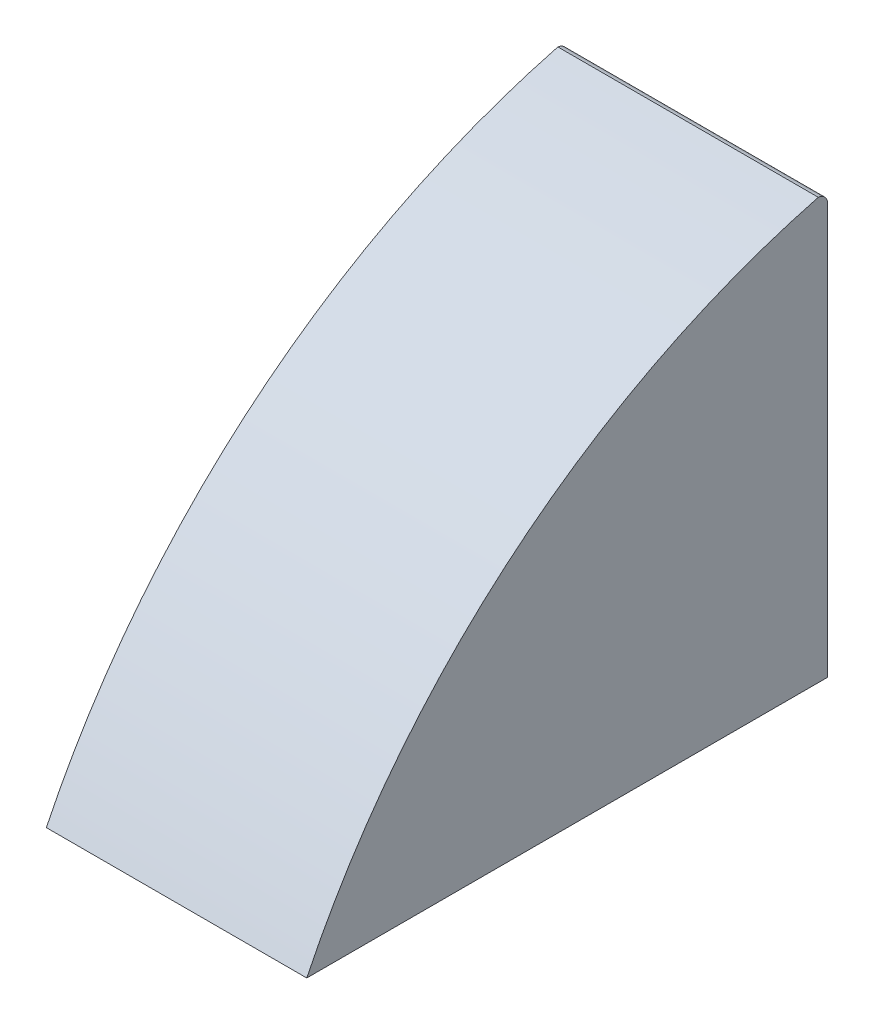
ISO-10303-21;
HEADER;
FILE_DESCRIPTION(('STEP AP214'),'2;1');
FILE_NAME('part.step','',(''),(''),'','','');
FILE_SCHEMA(('AUTOMOTIVE_DESIGN { 1 0 10303 214 1 1 1 1 }'));
ENDSEC;
DATA;
#1=APPLICATION_CONTEXT('core data for automotive mechanical design processes');
#2=APPLICATION_PROTOCOL_DEFINITION('international standard','automotive_design',2000,#1);
#3=PRODUCT_CONTEXT('',#1,'mechanical');
#4=PRODUCT('Part','Part','',(#3));
#5=PRODUCT_RELATED_PRODUCT_CATEGORY('part','',(#4));
#6=PRODUCT_DEFINITION_FORMATION('','',#4);
#7=PRODUCT_DEFINITION_CONTEXT('part definition',#1,'design');
#8=PRODUCT_DEFINITION('design','',#6,#7);
#9=PRODUCT_DEFINITION_SHAPE('','',#8);
#10=(LENGTH_UNIT() NAMED_UNIT(*) SI_UNIT(.MILLI.,.METRE.));
#11=(NAMED_UNIT(*) PLANE_ANGLE_UNIT() SI_UNIT($,.RADIAN.));
#12=(NAMED_UNIT(*) SI_UNIT($,.STERADIAN.) SOLID_ANGLE_UNIT());
#13=UNCERTAINTY_MEASURE_WITH_UNIT(LENGTH_MEASURE(1.E-05),#10,'distance_accuracy_value','');
#14=(GEOMETRIC_REPRESENTATION_CONTEXT(3) GLOBAL_UNCERTAINTY_ASSIGNED_CONTEXT((#13)) GLOBAL_UNIT_ASSIGNED_CONTEXT((#10,
#11,#12)) REPRESENTATION_CONTEXT('',''));
#15=CARTESIAN_POINT('',(0.,0.,0.));
#16=DIRECTION('',(0.,0.,1.));
#17=DIRECTION('',(1.,0.,0.));
#18=AXIS2_PLACEMENT_3D('',#15,#16,#17);
#19=CARTESIAN_POINT('',(6.35,4.9408516664707,4.43585997943218));
#20=DIRECTION('',(0.,0.,1.));
#21=DIRECTION('',(0.,-1.,0.));
#22=AXIS2_PLACEMENT_3D('',#19,#20,#21);
#23=PLANE('',#22);
#24=DIRECTION('',(0.,1.,0.));
#25=VECTOR('',#24,1.);
#26=CARTESIAN_POINT('',(0.,4.9408516664707,4.43585997943218));
#27=LINE('',#26,#25);
#28=CARTESIAN_POINT('',(0.,4.9408516664707,4.43585997943218));
#29=VERTEX_POINT('',#28);
#30=CARTESIAN_POINT('',(0.,14.9408516664707,4.43585997943218));
#31=VERTEX_POINT('',#30);
#32=EDGE_CURVE('E96',#29,#31,#27,.T.);
#33=ORIENTED_EDGE('',*,*,#32,.T.);
#34=DIRECTION('',(-1.,0.,0.));
#35=VECTOR('',#34,1.);
#36=CARTESIAN_POINT('',(6.35,14.9408516664707,4.43585997943218));
#37=LINE('',#36,#35);
#38=CARTESIAN_POINT('',(6.35,14.9408516664707,4.43585997943218));
#39=VERTEX_POINT('',#38);
#40=EDGE_CURVE('E11',#39,#31,#37,.T.);
#41=ORIENTED_EDGE('',*,*,#40,.F.);
#42=DIRECTION('',(0.,1.,0.));
#43=VECTOR('',#42,1.);
#44=CARTESIAN_POINT('',(6.35,4.9408516664707,4.43585997943218));
#45=LINE('',#44,#43);
#46=CARTESIAN_POINT('',(6.35,4.9408516664707,4.43585997943218));
#47=VERTEX_POINT('',#46);
#48=EDGE_CURVE('E84',#47,#39,#45,.T.);
#49=ORIENTED_EDGE('',*,*,#48,.F.);
#50=DIRECTION('',(-1.,0.,0.));
#51=VECTOR('',#50,1.);
#52=CARTESIAN_POINT('',(6.35,4.9408516664707,4.43585997943218));
#53=LINE('',#52,#51);
#54=EDGE_CURVE('E92',#47,#29,#53,.T.);
#55=ORIENTED_EDGE('',*,*,#54,.T.);
#56=EDGE_LOOP('',(#33,#41,#49,#55));
#57=FACE_BOUND('',#56,.T.);
#58=ADVANCED_FACE('F33',(#57),#23,.F.);
#59=CARTESIAN_POINT('',(6.35,14.9408516664707,4.68585997943218));
#60=DIRECTION('',(-1.,0.,0.));
#61=DIRECTION('',(0.,0.,1.));
#62=AXIS2_PLACEMENT_3D('',#59,#60,#61);
#63=CYLINDRICAL_SURFACE('',#62,0.250000000000001);
#64=CARTESIAN_POINT('',(0.,14.9408516664707,4.68585997943218));
#65=DIRECTION('',(1.,0.,0.));
#66=DIRECTION('',(0.,0.,-1.));
#67=AXIS2_PLACEMENT_3D('',#64,#65,#66);
#68=CIRCLE('',#67,0.250000000000001);
#69=CARTESIAN_POINT('',(0.,15.1898809147992,4.66385012988849));
#70=VERTEX_POINT('',#69);
#71=EDGE_CURVE('E88',#31,#70,#68,.T.);
#72=ORIENTED_EDGE('',*,*,#71,.T.);
#73=DIRECTION('',(-1.,0.,0.));
#74=VECTOR('',#73,1.);
#75=CARTESIAN_POINT('',(6.35,15.1898809147992,4.66385012988849));
#76=LINE('',#75,#74);
#77=CARTESIAN_POINT('',(6.35,15.1898809147992,4.66385012988849));
#78=VERTEX_POINT('',#77);
#79=EDGE_CURVE('E41',#78,#70,#76,.T.);
#80=ORIENTED_EDGE('',*,*,#79,.F.);
#81=CARTESIAN_POINT('',(6.35,14.9408516664707,4.68585997943218));
#82=DIRECTION('',(1.,0.,0.));
#83=DIRECTION('',(0.,0.,-1.));
#84=AXIS2_PLACEMENT_3D('',#81,#82,#83);
#85=CIRCLE('',#84,0.250000000000001);
#86=EDGE_CURVE('E79',#39,#78,#85,.T.);
#87=ORIENTED_EDGE('',*,*,#86,.F.);
#88=ORIENTED_EDGE('',*,*,#40,.T.);
#89=EDGE_LOOP('',(#72,#80,#87,#88));
#90=FACE_BOUND('',#89,.T.);
#91=ADVANCED_FACE('F87',(#90),#63,.T.);
#92=CARTESIAN_POINT('',(6.35,-3.42945915466807,-0.189685633527848));
#93=DIRECTION('',(-1.,0.,0.));
#94=DIRECTION('',(0.,0.,1.));
#95=AXIS2_PLACEMENT_3D('',#92,#93,#94);
#96=CYLINDRICAL_SURFACE('',#95,19.2415340872091);
#97=CARTESIAN_POINT('',(0.,-3.42945915466807,-0.189685633527848));
#98=DIRECTION('',(1.,0.,0.));
#99=DIRECTION('',(0.,0.,1.));
#100=AXIS2_PLACEMENT_3D('',#97,#98,#99);
#101=CIRCLE('',#100,19.2415340872091);
#102=CARTESIAN_POINT('',(0.,4.9408516664707,17.1358599794322));
#103=VERTEX_POINT('',#102);
#104=EDGE_CURVE('E66',#70,#103,#101,.T.);
#105=ORIENTED_EDGE('',*,*,#104,.T.);
#106=DIRECTION('',(-1.,0.,0.));
#107=VECTOR('',#106,1.);
#108=CARTESIAN_POINT('',(6.35,4.9408516664707,17.1358599794322));
#109=LINE('',#108,#107);
#110=CARTESIAN_POINT('',(6.35,4.9408516664707,17.1358599794322));
#111=VERTEX_POINT('',#110);
#112=EDGE_CURVE('E89',#111,#103,#109,.T.);
#113=ORIENTED_EDGE('',*,*,#112,.F.);
#114=CARTESIAN_POINT('',(6.35,-3.42945915466807,-0.189685633527848));
#115=DIRECTION('',(1.,0.,0.));
#116=DIRECTION('',(0.,0.,1.));
#117=AXIS2_PLACEMENT_3D('',#114,#115,#116);
#118=CIRCLE('',#117,19.2415340872091);
#119=EDGE_CURVE('E82',#78,#111,#118,.T.);
#120=ORIENTED_EDGE('',*,*,#119,.F.);
#121=ORIENTED_EDGE('',*,*,#79,.T.);
#122=EDGE_LOOP('',(#105,#113,#120,#121));
#123=FACE_BOUND('',#122,.T.);
#124=ADVANCED_FACE('F90',(#123),#96,.T.);
#125=CARTESIAN_POINT('',(6.35,4.9408516664707,17.1358599794322));
#126=DIRECTION('',(0.,1.,0.));
#127=DIRECTION('',(0.,0.,1.));
#128=AXIS2_PLACEMENT_3D('',#125,#126,#127);
#129=PLANE('',#128);
#130=DIRECTION('',(0.,0.,-1.));
#131=VECTOR('',#130,1.);
#132=CARTESIAN_POINT('',(0.,4.9408516664707,17.1358599794322));
#133=LINE('',#132,#131);
#134=EDGE_CURVE('E72',#103,#29,#133,.T.);
#135=ORIENTED_EDGE('',*,*,#134,.T.);
#136=ORIENTED_EDGE('',*,*,#54,.F.);
#137=DIRECTION('',(0.,0.,-1.));
#138=VECTOR('',#137,1.);
#139=CARTESIAN_POINT('',(6.35,4.9408516664707,17.1358599794322));
#140=LINE('',#139,#138);
#141=EDGE_CURVE('E49',#111,#47,#140,.T.);
#142=ORIENTED_EDGE('',*,*,#141,.F.);
#143=ORIENTED_EDGE('',*,*,#112,.T.);
#144=EDGE_LOOP('',(#135,#136,#142,#143));
#145=FACE_BOUND('',#144,.T.);
#146=ADVANCED_FACE('F103',(#145),#129,.F.);
#147=CARTESIAN_POINT('',(6.35,14.9408516664707,4.68585997943218));
#148=DIRECTION('',(1.,0.,0.));
#149=DIRECTION('',(0.,0.,-1.));
#150=AXIS2_PLACEMENT_3D('',#147,#148,#149);
#151=PLANE('',#150);
#152=ORIENTED_EDGE('',*,*,#48,.T.);
#153=ORIENTED_EDGE('',*,*,#86,.T.);
#154=ORIENTED_EDGE('',*,*,#119,.T.);
#155=ORIENTED_EDGE('',*,*,#141,.T.);
#156=EDGE_LOOP('',(#152,#153,#154,#155));
#157=FACE_BOUND('',#156,.T.);
#158=ADVANCED_FACE('F80',(#157),#151,.T.);
#159=CARTESIAN_POINT('',(0.,14.9408516664707,4.68585997943218));
#160=DIRECTION('',(1.,0.,0.));
#161=DIRECTION('',(0.,0.,-1.));
#162=AXIS2_PLACEMENT_3D('',#159,#160,#161);
#163=PLANE('',#162);
#164=ORIENTED_EDGE('',*,*,#32,.F.);
#165=ORIENTED_EDGE('',*,*,#134,.F.);
#166=ORIENTED_EDGE('',*,*,#104,.F.);
#167=ORIENTED_EDGE('',*,*,#71,.F.);
#168=EDGE_LOOP('',(#164,#165,#166,#167));
#169=FACE_BOUND('',#168,.T.);
#170=ADVANCED_FACE('F106',(#169),#163,.F.);
#171=CLOSED_SHELL('',(#58,#91,#124,#146,#158,#170));
#172=MANIFOLD_SOLID_BREP('B2',#171);
#173=ADVANCED_BREP_SHAPE_REPRESENTATION('',(#18,#172),#14);
#174=SHAPE_DEFINITION_REPRESENTATION(#9,#173);
ENDSEC;
END-ISO-10303-21;
